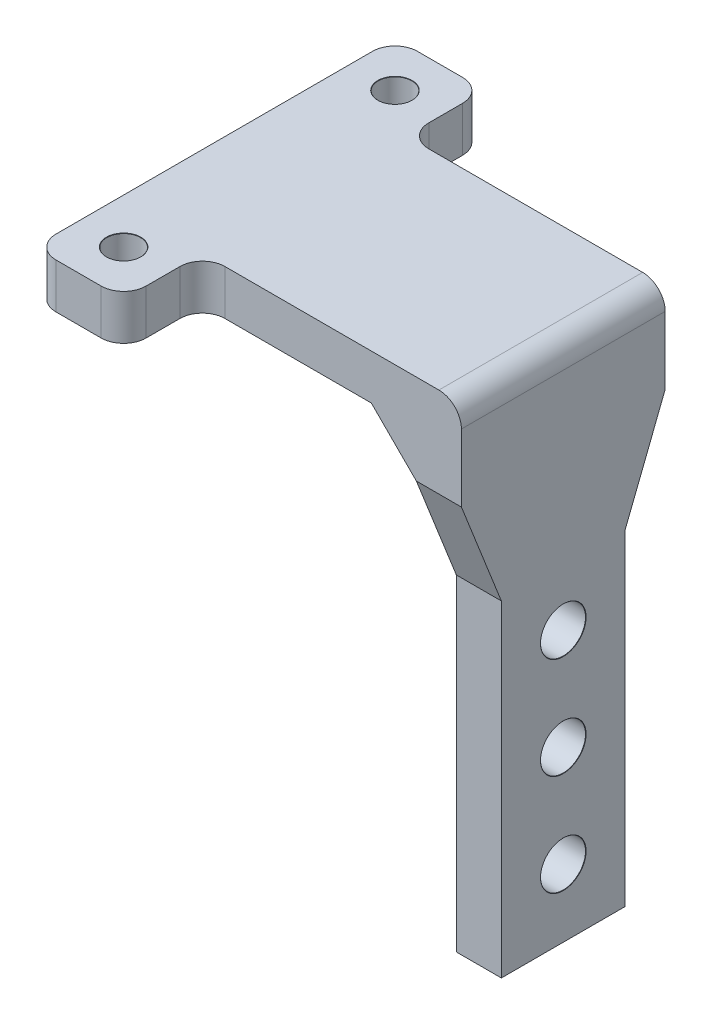
ISO-10303-21;
HEADER;
FILE_DESCRIPTION(('STEP AP214'),'2;1');
FILE_NAME('part.step','',(''),(''),'','','');
FILE_SCHEMA(('AUTOMOTIVE_DESIGN { 1 0 10303 214 1 1 1 1 }'));
ENDSEC;
DATA;
#1=APPLICATION_CONTEXT('core data for automotive mechanical design processes');
#2=APPLICATION_PROTOCOL_DEFINITION('international standard','automotive_design',2000,#1);
#3=PRODUCT_CONTEXT('',#1,'mechanical');
#4=PRODUCT('Part','Part','',(#3));
#5=PRODUCT_RELATED_PRODUCT_CATEGORY('part','',(#4));
#6=PRODUCT_DEFINITION_FORMATION('','',#4);
#7=PRODUCT_DEFINITION_CONTEXT('part definition',#1,'design');
#8=PRODUCT_DEFINITION('design','',#6,#7);
#9=PRODUCT_DEFINITION_SHAPE('','',#8);
#10=(LENGTH_UNIT() NAMED_UNIT(*) SI_UNIT(.MILLI.,.METRE.));
#11=(NAMED_UNIT(*) PLANE_ANGLE_UNIT() SI_UNIT($,.RADIAN.));
#12=(NAMED_UNIT(*) SI_UNIT($,.STERADIAN.) SOLID_ANGLE_UNIT());
#13=UNCERTAINTY_MEASURE_WITH_UNIT(LENGTH_MEASURE(1.E-05),#10,'distance_accuracy_value','');
#14=(GEOMETRIC_REPRESENTATION_CONTEXT(3) GLOBAL_UNCERTAINTY_ASSIGNED_CONTEXT((#13)) GLOBAL_UNIT_ASSIGNED_CONTEXT((#10,
#11,#12)) REPRESENTATION_CONTEXT('',''));
#15=CARTESIAN_POINT('',(0.,0.,0.));
#16=DIRECTION('',(0.,0.,1.));
#17=DIRECTION('',(1.,0.,0.));
#18=AXIS2_PLACEMENT_3D('',#15,#16,#17);
#19=CARTESIAN_POINT('',(0.,0.,0.));
#20=DIRECTION('',(0.,1.,0.));
#21=DIRECTION('',(0.,0.,1.));
#22=AXIS2_PLACEMENT_3D('',#19,#20,#21);
#23=PLANE('',#22);
#24=CARTESIAN_POINT('',(4.,0.,12.05));
#25=DIRECTION('',(0.,1.,0.));
#26=DIRECTION('',(0.,0.,1.));
#27=AXIS2_PLACEMENT_3D('',#24,#25,#26);
#28=CIRCLE('',#27,1.5);
#29=CARTESIAN_POINT('',(4.,0.,13.55));
#30=VERTEX_POINT('',#29);
#31=EDGE_CURVE('E342',#30,#30,#28,.T.);
#32=ORIENTED_EDGE('',*,*,#31,.T.);
#33=EDGE_LOOP('',(#32));
#34=FACE_BOUND('',#33,.T.);
#35=CARTESIAN_POINT('',(4.,0.,-12.05));
#36=DIRECTION('',(0.,1.,0.));
#37=DIRECTION('',(0.,0.,1.));
#38=AXIS2_PLACEMENT_3D('',#35,#36,#37);
#39=CIRCLE('',#38,1.5);
#40=CARTESIAN_POINT('',(4.,0.,-10.55));
#41=VERTEX_POINT('',#40);
#42=EDGE_CURVE('E333',#41,#41,#39,.T.);
#43=ORIENTED_EDGE('',*,*,#42,.T.);
#44=EDGE_LOOP('',(#43));
#45=FACE_BOUND('',#44,.T.);
#46=DIRECTION('',(-1.,0.,0.));
#47=VECTOR('',#46,1.);
#48=CARTESIAN_POINT('',(31.,0.,-9.05));
#49=LINE('',#48,#47);
#50=CARTESIAN_POINT('',(23.,0.,-9.05));
#51=VERTEX_POINT('',#50);
#52=CARTESIAN_POINT('',(10.,0.,-9.05));
#53=VERTEX_POINT('',#52);
#54=EDGE_CURVE('E379',#51,#53,#49,.T.);
#55=ORIENTED_EDGE('',*,*,#54,.F.);
#56=DIRECTION('',(0.,0.,1.));
#57=VECTOR('',#56,1.);
#58=CARTESIAN_POINT('',(23.,0.,9.05));
#59=LINE('',#58,#57);
#60=CARTESIAN_POINT('',(23.,0.,9.05));
#61=VERTEX_POINT('',#60);
#62=EDGE_CURVE('E278',#51,#61,#59,.T.);
#63=ORIENTED_EDGE('',*,*,#62,.T.);
#64=DIRECTION('',(1.,0.,0.));
#65=VECTOR('',#64,1.);
#66=CARTESIAN_POINT('',(8.,0.,9.05));
#67=LINE('',#66,#65);
#68=CARTESIAN_POINT('',(10.,0.,9.05));
#69=VERTEX_POINT('',#68);
#70=EDGE_CURVE('E377',#69,#61,#67,.T.);
#71=ORIENTED_EDGE('',*,*,#70,.F.);
#72=CARTESIAN_POINT('',(10.,0.,11.05));
#73=DIRECTION('',(0.,1.,0.));
#74=DIRECTION('',(0.,0.,1.));
#75=AXIS2_PLACEMENT_3D('',#72,#73,#74);
#76=CIRCLE('',#75,2.);
#77=CARTESIAN_POINT('',(8.,0.,11.05));
#78=VERTEX_POINT('',#77);
#79=EDGE_CURVE('E271',#69,#78,#76,.T.);
#80=ORIENTED_EDGE('',*,*,#79,.T.);
#81=DIRECTION('',(0.,0.,-1.));
#82=VECTOR('',#81,1.);
#83=CARTESIAN_POINT('',(8.,0.,16.05));
#84=LINE('',#83,#82);
#85=CARTESIAN_POINT('',(8.,0.,14.05));
#86=VERTEX_POINT('',#85);
#87=EDGE_CURVE('E374',#86,#78,#84,.T.);
#88=ORIENTED_EDGE('',*,*,#87,.F.);
#89=CARTESIAN_POINT('',(6.,0.,14.05));
#90=DIRECTION('',(0.,1.,0.));
#91=DIRECTION('',(0.,0.,1.));
#92=AXIS2_PLACEMENT_3D('',#89,#90,#91);
#93=CIRCLE('',#92,2.);
#94=CARTESIAN_POINT('',(6.,0.,16.05));
#95=VERTEX_POINT('',#94);
#96=EDGE_CURVE('E224',#86,#95,#93,.F.);
#97=ORIENTED_EDGE('',*,*,#96,.T.);
#98=DIRECTION('',(1.,0.,0.));
#99=VECTOR('',#98,1.);
#100=CARTESIAN_POINT('',(0.,0.,16.05));
#101=LINE('',#100,#99);
#102=CARTESIAN_POINT('',(2.,0.,16.05));
#103=VERTEX_POINT('',#102);
#104=EDGE_CURVE('E371',#103,#95,#101,.T.);
#105=ORIENTED_EDGE('',*,*,#104,.F.);
#106=CARTESIAN_POINT('',(2.,0.,14.05));
#107=DIRECTION('',(0.,1.,0.));
#108=DIRECTION('',(0.,0.,1.));
#109=AXIS2_PLACEMENT_3D('',#106,#107,#108);
#110=CIRCLE('',#109,2.);
#111=CARTESIAN_POINT('',(0.,0.,14.05));
#112=VERTEX_POINT('',#111);
#113=EDGE_CURVE('E226',#103,#112,#110,.F.);
#114=ORIENTED_EDGE('',*,*,#113,.T.);
#115=DIRECTION('',(0.,0.,1.));
#116=VECTOR('',#115,1.);
#117=CARTESIAN_POINT('',(0.,0.,-16.05));
#118=LINE('',#117,#116);
#119=CARTESIAN_POINT('',(0.,0.,-14.05));
#120=VERTEX_POINT('',#119);
#121=EDGE_CURVE('E368',#120,#112,#118,.T.);
#122=ORIENTED_EDGE('',*,*,#121,.F.);
#123=CARTESIAN_POINT('',(2.,0.,-14.05));
#124=DIRECTION('',(0.,1.,0.));
#125=DIRECTION('',(0.,0.,1.));
#126=AXIS2_PLACEMENT_3D('',#123,#124,#125);
#127=CIRCLE('',#126,2.);
#128=CARTESIAN_POINT('',(2.,0.,-16.05));
#129=VERTEX_POINT('',#128);
#130=EDGE_CURVE('E230',#120,#129,#127,.F.);
#131=ORIENTED_EDGE('',*,*,#130,.T.);
#132=DIRECTION('',(-1.,0.,0.));
#133=VECTOR('',#132,1.);
#134=CARTESIAN_POINT('',(8.,0.,-16.05));
#135=LINE('',#134,#133);
#136=CARTESIAN_POINT('',(6.,0.,-16.05));
#137=VERTEX_POINT('',#136);
#138=EDGE_CURVE('E345',#137,#129,#135,.T.);
#139=ORIENTED_EDGE('',*,*,#138,.F.);
#140=CARTESIAN_POINT('',(6.,0.,-14.05));
#141=DIRECTION('',(0.,1.,0.));
#142=DIRECTION('',(0.,0.,1.));
#143=AXIS2_PLACEMENT_3D('',#140,#141,#142);
#144=CIRCLE('',#143,2.);
#145=CARTESIAN_POINT('',(8.,0.,-14.05));
#146=VERTEX_POINT('',#145);
#147=EDGE_CURVE('E228',#137,#146,#144,.F.);
#148=ORIENTED_EDGE('',*,*,#147,.T.);
#149=DIRECTION('',(0.,0.,-1.));
#150=VECTOR('',#149,1.);
#151=CARTESIAN_POINT('',(8.,0.,-9.05));
#152=LINE('',#151,#150);
#153=CARTESIAN_POINT('',(8.,0.,-11.05));
#154=VERTEX_POINT('',#153);
#155=EDGE_CURVE('E350',#154,#146,#152,.T.);
#156=ORIENTED_EDGE('',*,*,#155,.F.);
#157=CARTESIAN_POINT('',(10.,0.,-11.05));
#158=DIRECTION('',(0.,1.,0.));
#159=DIRECTION('',(0.,0.,1.));
#160=AXIS2_PLACEMENT_3D('',#157,#158,#159);
#161=CIRCLE('',#160,2.);
#162=EDGE_CURVE('E266',#154,#53,#161,.T.);
#163=ORIENTED_EDGE('',*,*,#162,.T.);
#164=EDGE_LOOP('',(#55,#63,#71,#80,#88,#97,#105,#114,#122,#131,#139,#148,#156,#163));
#165=FACE_BOUND('',#164,.T.);
#166=ADVANCED_FACE('F41',(#34,#45,#165),#23,.F.);
#167=CARTESIAN_POINT('',(8.,4.,-16.05));
#168=DIRECTION('',(0.,0.,1.));
#169=DIRECTION('',(1.,0.,0.));
#170=AXIS2_PLACEMENT_3D('',#167,#168,#169);
#171=PLANE('',#170);
#172=ORIENTED_EDGE('',*,*,#138,.T.);
#173=DIRECTION('',(0.,-1.,0.));
#174=VECTOR('',#173,1.);
#175=CARTESIAN_POINT('',(2.,4.,-16.05));
#176=LINE('',#175,#174);
#177=CARTESIAN_POINT('',(2.,4.,-16.05));
#178=VERTEX_POINT('',#177);
#179=EDGE_CURVE('E235',#129,#178,#176,.F.);
#180=ORIENTED_EDGE('',*,*,#179,.T.);
#181=DIRECTION('',(-1.,0.,0.));
#182=VECTOR('',#181,1.);
#183=CARTESIAN_POINT('',(8.,4.,-16.05));
#184=LINE('',#183,#182);
#185=CARTESIAN_POINT('',(6.,4.,-16.05));
#186=VERTEX_POINT('',#185);
#187=EDGE_CURVE('E346',#186,#178,#184,.T.);
#188=ORIENTED_EDGE('',*,*,#187,.F.);
#189=DIRECTION('',(0.,-1.,0.));
#190=VECTOR('',#189,1.);
#191=CARTESIAN_POINT('',(6.,4.,-16.05));
#192=LINE('',#191,#190);
#193=EDGE_CURVE('E232',#186,#137,#192,.T.);
#194=ORIENTED_EDGE('',*,*,#193,.T.);
#195=EDGE_LOOP('',(#172,#180,#188,#194));
#196=FACE_BOUND('',#195,.T.);
#197=ADVANCED_FACE('F397',(#196),#171,.F.);
#198=CARTESIAN_POINT('',(0.,4.,-16.05));
#199=DIRECTION('',(1.,0.,0.));
#200=DIRECTION('',(0.,0.,-1.));
#201=AXIS2_PLACEMENT_3D('',#198,#199,#200);
#202=PLANE('',#201);
#203=DIRECTION('',(0.,0.,1.));
#204=VECTOR('',#203,1.);
#205=CARTESIAN_POINT('',(0.,4.,-16.05));
#206=LINE('',#205,#204);
#207=CARTESIAN_POINT('',(0.,4.,-14.05));
#208=VERTEX_POINT('',#207);
#209=CARTESIAN_POINT('',(0.,4.,14.05));
#210=VERTEX_POINT('',#209);
#211=EDGE_CURVE('E349',#208,#210,#206,.T.);
#212=ORIENTED_EDGE('',*,*,#211,.F.);
#213=DIRECTION('',(0.,-1.,0.));
#214=VECTOR('',#213,1.);
#215=CARTESIAN_POINT('',(0.,4.,-14.05));
#216=LINE('',#215,#214);
#217=EDGE_CURVE('E215',#208,#120,#216,.T.);
#218=ORIENTED_EDGE('',*,*,#217,.T.);
#219=ORIENTED_EDGE('',*,*,#121,.T.);
#220=DIRECTION('',(0.,-1.,0.));
#221=VECTOR('',#220,1.);
#222=CARTESIAN_POINT('',(0.,4.,14.05));
#223=LINE('',#222,#221);
#224=EDGE_CURVE('E212',#112,#210,#223,.F.);
#225=ORIENTED_EDGE('',*,*,#224,.T.);
#226=EDGE_LOOP('',(#212,#218,#219,#225));
#227=FACE_BOUND('',#226,.T.);
#228=ADVANCED_FACE('F406',(#227),#202,.F.);
#229=CARTESIAN_POINT('',(0.,4.,16.05));
#230=DIRECTION('',(0.,0.,-1.));
#231=DIRECTION('',(-1.,0.,0.));
#232=AXIS2_PLACEMENT_3D('',#229,#230,#231);
#233=PLANE('',#232);
#234=DIRECTION('',(1.,0.,0.));
#235=VECTOR('',#234,1.);
#236=CARTESIAN_POINT('',(0.,4.,16.05));
#237=LINE('',#236,#235);
#238=CARTESIAN_POINT('',(2.,4.,16.05));
#239=VERTEX_POINT('',#238);
#240=CARTESIAN_POINT('',(6.,4.,16.05));
#241=VERTEX_POINT('',#240);
#242=EDGE_CURVE('E353',#239,#241,#237,.T.);
#243=ORIENTED_EDGE('',*,*,#242,.F.);
#244=DIRECTION('',(0.,-1.,0.));
#245=VECTOR('',#244,1.);
#246=CARTESIAN_POINT('',(2.,4.,16.05));
#247=LINE('',#246,#245);
#248=EDGE_CURVE('E255',#239,#103,#247,.T.);
#249=ORIENTED_EDGE('',*,*,#248,.T.);
#250=ORIENTED_EDGE('',*,*,#104,.T.);
#251=DIRECTION('',(0.,-1.,0.));
#252=VECTOR('',#251,1.);
#253=CARTESIAN_POINT('',(6.,4.,16.05));
#254=LINE('',#253,#252);
#255=EDGE_CURVE('E253',#95,#241,#254,.F.);
#256=ORIENTED_EDGE('',*,*,#255,.T.);
#257=EDGE_LOOP('',(#243,#249,#250,#256));
#258=FACE_BOUND('',#257,.T.);
#259=ADVANCED_FACE('F415',(#258),#233,.F.);
#260=CARTESIAN_POINT('',(8.,4.,16.05));
#261=DIRECTION('',(-1.,0.,0.));
#262=DIRECTION('',(0.,0.,1.));
#263=AXIS2_PLACEMENT_3D('',#260,#261,#262);
#264=PLANE('',#263);
#265=DIRECTION('',(0.,0.,-1.));
#266=VECTOR('',#265,1.);
#267=CARTESIAN_POINT('',(8.,4.,16.05));
#268=LINE('',#267,#266);
#269=CARTESIAN_POINT('',(8.,4.,14.05));
#270=VERTEX_POINT('',#269);
#271=CARTESIAN_POINT('',(8.,4.,11.05));
#272=VERTEX_POINT('',#271);
#273=EDGE_CURVE('E356',#270,#272,#268,.T.);
#274=ORIENTED_EDGE('',*,*,#273,.F.);
#275=DIRECTION('',(0.,-1.,0.));
#276=VECTOR('',#275,1.);
#277=CARTESIAN_POINT('',(8.,4.,14.05));
#278=LINE('',#277,#276);
#279=EDGE_CURVE('E260',#270,#86,#278,.T.);
#280=ORIENTED_EDGE('',*,*,#279,.T.);
#281=ORIENTED_EDGE('',*,*,#87,.T.);
#282=DIRECTION('',(0.,-1.,0.));
#283=VECTOR('',#282,1.);
#284=CARTESIAN_POINT('',(8.,4.,11.05));
#285=LINE('',#284,#283);
#286=EDGE_CURVE('E258',#78,#272,#285,.F.);
#287=ORIENTED_EDGE('',*,*,#286,.T.);
#288=EDGE_LOOP('',(#274,#280,#281,#287));
#289=FACE_BOUND('',#288,.T.);
#290=ADVANCED_FACE('F424',(#289),#264,.F.);
#291=CARTESIAN_POINT('',(8.,4.,9.05));
#292=DIRECTION('',(0.,0.,-1.));
#293=DIRECTION('',(-1.,0.,0.));
#294=AXIS2_PLACEMENT_3D('',#291,#292,#293);
#295=PLANE('',#294);
#296=DIRECTION('',(-0.707106781186544,0.707106781186551,0.));
#297=VECTOR('',#296,1.);
#298=CARTESIAN_POINT('',(13.5000000000001,9.50000000000002,9.05));
#299=LINE('',#298,#297);
#300=CARTESIAN_POINT('',(27.,-4.00000000000005,9.05));
#301=VERTEX_POINT('',#300);
#302=EDGE_CURVE('E205',#61,#301,#299,.F.);
#303=ORIENTED_EDGE('',*,*,#302,.T.);
#304=DIRECTION('',(-1.,0.,0.));
#305=VECTOR('',#304,1.);
#306=CARTESIAN_POINT('',(31.,-4.00000000000005,9.05));
#307=LINE('',#306,#305);
#308=CARTESIAN_POINT('',(31.,-4.00000000000005,9.05));
#309=VERTEX_POINT('',#308);
#310=EDGE_CURVE('E188',#309,#301,#307,.T.);
#311=ORIENTED_EDGE('',*,*,#310,.F.);
#312=DIRECTION('',(0.,-1.,0.));
#313=VECTOR('',#312,1.);
#314=CARTESIAN_POINT('',(31.,4.,9.05));
#315=LINE('',#314,#313);
#316=CARTESIAN_POINT('',(31.,2.,9.05));
#317=VERTEX_POINT('',#316);
#318=EDGE_CURVE('E201',#317,#309,#315,.T.);
#319=ORIENTED_EDGE('',*,*,#318,.F.);
#320=CARTESIAN_POINT('',(29.,2.,9.05));
#321=DIRECTION('',(0.,0.,-1.));
#322=DIRECTION('',(-1.,0.,0.));
#323=AXIS2_PLACEMENT_3D('',#320,#321,#322);
#324=CIRCLE('',#323,2.);
#325=CARTESIAN_POINT('',(29.,4.,9.05));
#326=VERTEX_POINT('',#325);
#327=EDGE_CURVE('E49',#317,#326,#324,.F.);
#328=ORIENTED_EDGE('',*,*,#327,.T.);
#329=DIRECTION('',(1.,0.,0.));
#330=VECTOR('',#329,1.);
#331=CARTESIAN_POINT('',(8.,4.,9.05));
#332=LINE('',#331,#330);
#333=CARTESIAN_POINT('',(10.,4.,9.05));
#334=VERTEX_POINT('',#333);
#335=EDGE_CURVE('E359',#334,#326,#332,.T.);
#336=ORIENTED_EDGE('',*,*,#335,.F.);
#337=DIRECTION('',(0.,-1.,0.));
#338=VECTOR('',#337,1.);
#339=CARTESIAN_POINT('',(10.,0.,9.05));
#340=LINE('',#339,#338);
#341=EDGE_CURVE('E263',#334,#69,#340,.T.);
#342=ORIENTED_EDGE('',*,*,#341,.T.);
#343=ORIENTED_EDGE('',*,*,#70,.T.);
#344=EDGE_LOOP('',(#303,#311,#319,#328,#336,#342,#343));
#345=FACE_BOUND('',#344,.T.);
#346=ADVANCED_FACE('F200',(#345),#295,.F.);
#347=CARTESIAN_POINT('',(31.,4.,9.05));
#348=DIRECTION('',(-1.,0.,0.));
#349=DIRECTION('',(0.,0.,1.));
#350=AXIS2_PLACEMENT_3D('',#347,#348,#349);
#351=PLANE('',#350);
#352=CARTESIAN_POINT('',(31.,-36.,0.));
#353=DIRECTION('',(1.,0.,0.));
#354=DIRECTION('',(0.,0.,-1.));
#355=AXIS2_PLACEMENT_3D('',#352,#353,#354);
#356=CIRCLE('',#355,2.025);
#357=CARTESIAN_POINT('',(31.,-36.,-2.025));
#358=VERTEX_POINT('',#357);
#359=EDGE_CURVE('E308',#358,#358,#356,.T.);
#360=ORIENTED_EDGE('',*,*,#359,.F.);
#361=EDGE_LOOP('',(#360));
#362=FACE_BOUND('',#361,.T.);
#363=CARTESIAN_POINT('',(31.,-27.,0.));
#364=DIRECTION('',(1.,0.,0.));
#365=DIRECTION('',(0.,0.,-1.));
#366=AXIS2_PLACEMENT_3D('',#363,#364,#365);
#367=CIRCLE('',#366,2.025);
#368=CARTESIAN_POINT('',(31.,-27.,-2.025));
#369=VERTEX_POINT('',#368);
#370=EDGE_CURVE('E301',#369,#369,#367,.T.);
#371=ORIENTED_EDGE('',*,*,#370,.F.);
#372=EDGE_LOOP('',(#371));
#373=FACE_BOUND('',#372,.T.);
#374=CARTESIAN_POINT('',(31.,-18.,0.));
#375=DIRECTION('',(1.,0.,0.));
#376=DIRECTION('',(0.,0.,-1.));
#377=AXIS2_PLACEMENT_3D('',#374,#375,#376);
#378=CIRCLE('',#377,2.025);
#379=CARTESIAN_POINT('',(31.,-18.,-2.025));
#380=VERTEX_POINT('',#379);
#381=EDGE_CURVE('E297',#380,#380,#378,.T.);
#382=ORIENTED_EDGE('',*,*,#381,.F.);
#383=EDGE_LOOP('',(#382));
#384=FACE_BOUND('',#383,.T.);
#385=DIRECTION('',(0.,-0.930248086317103,-0.366931189602858));
#386=VECTOR('',#385,1.);
#387=CARTESIAN_POINT('',(31.,-4.00000000000005,9.05));
#388=LINE('',#387,#386);
#389=CARTESIAN_POINT('',(31.,-13.,5.5));
#390=VERTEX_POINT('',#389);
#391=EDGE_CURVE('E184',#309,#390,#388,.T.);
#392=ORIENTED_EDGE('',*,*,#391,.T.);
#393=DIRECTION('',(0.,-1.,0.));
#394=VECTOR('',#393,1.);
#395=CARTESIAN_POINT('',(31.,-13.,5.5));
#396=LINE('',#395,#394);
#397=CARTESIAN_POINT('',(31.,-42.,5.5));
#398=VERTEX_POINT('',#397);
#399=EDGE_CURVE('E195',#390,#398,#396,.T.);
#400=ORIENTED_EDGE('',*,*,#399,.T.);
#401=DIRECTION('',(0.,0.,1.));
#402=VECTOR('',#401,1.);
#403=CARTESIAN_POINT('',(31.,-42.,9.05));
#404=LINE('',#403,#402);
#405=CARTESIAN_POINT('',(31.,-42.,-5.499999999941));
#406=VERTEX_POINT('',#405);
#407=EDGE_CURVE('E293',#406,#398,#404,.T.);
#408=ORIENTED_EDGE('',*,*,#407,.F.);
#409=DIRECTION('',(0.,1.,0.));
#410=VECTOR('',#409,1.);
#411=CARTESIAN_POINT('',(31.,-13.,-5.499999999941));
#412=LINE('',#411,#410);
#413=CARTESIAN_POINT('',(31.,-13.,-5.499999999941));
#414=VERTEX_POINT('',#413);
#415=EDGE_CURVE('E64',#406,#414,#412,.T.);
#416=ORIENTED_EDGE('',*,*,#415,.T.);
#417=DIRECTION('',(0.,0.930248086315021,-0.366931189608135));
#418=VECTOR('',#417,1.);
#419=CARTESIAN_POINT('',(31.,-4.00000000000005,-9.05));
#420=LINE('',#419,#418);
#421=CARTESIAN_POINT('',(31.,-4.00000000000005,-9.05));
#422=VERTEX_POINT('',#421);
#423=EDGE_CURVE('E459',#414,#422,#420,.T.);
#424=ORIENTED_EDGE('',*,*,#423,.T.);
#425=DIRECTION('',(0.,-1.,0.));
#426=VECTOR('',#425,1.);
#427=CARTESIAN_POINT('',(31.,4.,-9.05));
#428=LINE('',#427,#426);
#429=CARTESIAN_POINT('',(31.,2.,-9.05));
#430=VERTEX_POINT('',#429);
#431=EDGE_CURVE('E213',#430,#422,#428,.T.);
#432=ORIENTED_EDGE('',*,*,#431,.F.);
#433=DIRECTION('',(0.,0.,-1.));
#434=VECTOR('',#433,1.);
#435=CARTESIAN_POINT('',(31.,2.,9.05));
#436=LINE('',#435,#434);
#437=EDGE_CURVE('E211',#430,#317,#436,.F.);
#438=ORIENTED_EDGE('',*,*,#437,.T.);
#439=ORIENTED_EDGE('',*,*,#318,.T.);
#440=EDGE_LOOP('',(#392,#400,#408,#416,#424,#432,#438,#439));
#441=FACE_BOUND('',#440,.T.);
#442=ADVANCED_FACE('F208',(#362,#373,#384,#441),#351,.F.);
#443=CARTESIAN_POINT('',(31.,4.,-9.05));
#444=DIRECTION('',(0.,0.,1.));
#445=DIRECTION('',(1.,0.,0.));
#446=AXIS2_PLACEMENT_3D('',#443,#444,#445);
#447=PLANE('',#446);
#448=ORIENTED_EDGE('',*,*,#431,.T.);
#449=DIRECTION('',(-1.,0.,0.));
#450=VECTOR('',#449,1.);
#451=CARTESIAN_POINT('',(31.,-4.00000000000005,-9.05));
#452=LINE('',#451,#450);
#453=CARTESIAN_POINT('',(27.,-4.00000000000005,-9.05));
#454=VERTEX_POINT('',#453);
#455=EDGE_CURVE('E463',#422,#454,#452,.T.);
#456=ORIENTED_EDGE('',*,*,#455,.T.);
#457=DIRECTION('',(0.707106781186544,-0.707106781186551,0.));
#458=VECTOR('',#457,1.);
#459=CARTESIAN_POINT('',(25.,-1.99999999999998,-9.05));
#460=LINE('',#459,#458);
#461=EDGE_CURVE('E280',#454,#51,#460,.F.);
#462=ORIENTED_EDGE('',*,*,#461,.T.);
#463=ORIENTED_EDGE('',*,*,#54,.T.);
#464=DIRECTION('',(0.,-1.,0.));
#465=VECTOR('',#464,1.);
#466=CARTESIAN_POINT('',(10.,4.,-9.05));
#467=LINE('',#466,#465);
#468=CARTESIAN_POINT('',(10.,4.,-9.05));
#469=VERTEX_POINT('',#468);
#470=EDGE_CURVE('E250',#53,#469,#467,.F.);
#471=ORIENTED_EDGE('',*,*,#470,.T.);
#472=DIRECTION('',(-1.,0.,0.));
#473=VECTOR('',#472,1.);
#474=CARTESIAN_POINT('',(31.,4.,-9.05));
#475=LINE('',#474,#473);
#476=CARTESIAN_POINT('',(29.,4.,-9.05));
#477=VERTEX_POINT('',#476);
#478=EDGE_CURVE('E362',#477,#469,#475,.T.);
#479=ORIENTED_EDGE('',*,*,#478,.F.);
#480=CARTESIAN_POINT('',(29.,2.,-9.05));
#481=DIRECTION('',(0.,0.,1.));
#482=DIRECTION('',(1.,0.,0.));
#483=AXIS2_PLACEMENT_3D('',#480,#481,#482);
#484=CIRCLE('',#483,2.);
#485=EDGE_CURVE('E286',#477,#430,#484,.F.);
#486=ORIENTED_EDGE('',*,*,#485,.T.);
#487=EDGE_LOOP('',(#448,#456,#462,#463,#471,#479,#486));
#488=FACE_BOUND('',#487,.T.);
#489=ADVANCED_FACE('F436',(#488),#447,.F.);
#490=CARTESIAN_POINT('',(8.,4.,-9.05));
#491=DIRECTION('',(-1.,0.,0.));
#492=DIRECTION('',(0.,0.,1.));
#493=AXIS2_PLACEMENT_3D('',#490,#491,#492);
#494=PLANE('',#493);
#495=DIRECTION('',(0.,0.,-1.));
#496=VECTOR('',#495,1.);
#497=CARTESIAN_POINT('',(8.,4.,-9.05));
#498=LINE('',#497,#496);
#499=CARTESIAN_POINT('',(8.,4.,-11.05));
#500=VERTEX_POINT('',#499);
#501=CARTESIAN_POINT('',(8.,4.,-14.05));
#502=VERTEX_POINT('',#501);
#503=EDGE_CURVE('E218',#500,#502,#498,.T.);
#504=ORIENTED_EDGE('',*,*,#503,.F.);
#505=DIRECTION('',(0.,-1.,0.));
#506=VECTOR('',#505,1.);
#507=CARTESIAN_POINT('',(8.,0.,-11.05));
#508=LINE('',#507,#506);
#509=EDGE_CURVE('E247',#500,#154,#508,.T.);
#510=ORIENTED_EDGE('',*,*,#509,.T.);
#511=ORIENTED_EDGE('',*,*,#155,.T.);
#512=DIRECTION('',(0.,-1.,0.));
#513=VECTOR('',#512,1.);
#514=CARTESIAN_POINT('',(8.,4.,-14.05));
#515=LINE('',#514,#513);
#516=EDGE_CURVE('E245',#146,#502,#515,.F.);
#517=ORIENTED_EDGE('',*,*,#516,.T.);
#518=EDGE_LOOP('',(#504,#510,#511,#517));
#519=FACE_BOUND('',#518,.T.);
#520=ADVANCED_FACE('F385',(#519),#494,.F.);
#521=CARTESIAN_POINT('',(0.,4.,0.));
#522=DIRECTION('',(0.,1.,0.));
#523=DIRECTION('',(0.,0.,1.));
#524=AXIS2_PLACEMENT_3D('',#521,#522,#523);
#525=PLANE('',#524);
#526=CARTESIAN_POINT('',(4.,4.,-12.05));
#527=DIRECTION('',(0.,1.,0.));
#528=DIRECTION('',(0.,0.,1.));
#529=AXIS2_PLACEMENT_3D('',#526,#527,#528);
#530=CIRCLE('',#529,1.525);
#531=CARTESIAN_POINT('',(4.,4.,-10.525));
#532=VERTEX_POINT('',#531);
#533=EDGE_CURVE('E327',#532,#532,#530,.T.);
#534=ORIENTED_EDGE('',*,*,#533,.F.);
#535=EDGE_LOOP('',(#534));
#536=FACE_BOUND('',#535,.T.);
#537=CARTESIAN_POINT('',(4.,4.,12.05));
#538=DIRECTION('',(0.,1.,0.));
#539=DIRECTION('',(0.,0.,1.));
#540=AXIS2_PLACEMENT_3D('',#537,#538,#539);
#541=CIRCLE('',#540,1.525);
#542=CARTESIAN_POINT('',(4.,4.,13.575));
#543=VERTEX_POINT('',#542);
#544=EDGE_CURVE('E336',#543,#543,#541,.T.);
#545=ORIENTED_EDGE('',*,*,#544,.F.);
#546=EDGE_LOOP('',(#545));
#547=FACE_BOUND('',#546,.T.);
#548=ORIENTED_EDGE('',*,*,#335,.T.);
#549=DIRECTION('',(0.,0.,-1.));
#550=VECTOR('',#549,1.);
#551=CARTESIAN_POINT('',(29.,4.,-9.05));
#552=LINE('',#551,#550);
#553=EDGE_CURVE('E283',#326,#477,#552,.T.);
#554=ORIENTED_EDGE('',*,*,#553,.T.);
#555=ORIENTED_EDGE('',*,*,#478,.T.);
#556=CARTESIAN_POINT('',(10.,4.,-11.05));
#557=DIRECTION('',(0.,1.,0.));
#558=DIRECTION('',(0.,0.,1.));
#559=AXIS2_PLACEMENT_3D('',#556,#557,#558);
#560=CIRCLE('',#559,2.);
#561=EDGE_CURVE('E269',#469,#500,#560,.F.);
#562=ORIENTED_EDGE('',*,*,#561,.T.);
#563=ORIENTED_EDGE('',*,*,#503,.T.);
#564=CARTESIAN_POINT('',(6.,4.,-14.05));
#565=DIRECTION('',(0.,1.,0.));
#566=DIRECTION('',(0.,0.,1.));
#567=AXIS2_PLACEMENT_3D('',#564,#565,#566);
#568=CIRCLE('',#567,2.);
#569=EDGE_CURVE('E241',#502,#186,#568,.T.);
#570=ORIENTED_EDGE('',*,*,#569,.T.);
#571=ORIENTED_EDGE('',*,*,#187,.T.);
#572=CARTESIAN_POINT('',(2.,4.,-14.05));
#573=DIRECTION('',(0.,1.,0.));
#574=DIRECTION('',(0.,0.,1.));
#575=AXIS2_PLACEMENT_3D('',#572,#573,#574);
#576=CIRCLE('',#575,2.);
#577=EDGE_CURVE('E243',#178,#208,#576,.T.);
#578=ORIENTED_EDGE('',*,*,#577,.T.);
#579=ORIENTED_EDGE('',*,*,#211,.T.);
#580=CARTESIAN_POINT('',(2.,4.,14.05));
#581=DIRECTION('',(0.,1.,0.));
#582=DIRECTION('',(0.,0.,1.));
#583=AXIS2_PLACEMENT_3D('',#580,#581,#582);
#584=CIRCLE('',#583,2.);
#585=EDGE_CURVE('E239',#210,#239,#584,.T.);
#586=ORIENTED_EDGE('',*,*,#585,.T.);
#587=ORIENTED_EDGE('',*,*,#242,.T.);
#588=CARTESIAN_POINT('',(6.,4.,14.05));
#589=DIRECTION('',(0.,1.,0.));
#590=DIRECTION('',(0.,0.,1.));
#591=AXIS2_PLACEMENT_3D('',#588,#589,#590);
#592=CIRCLE('',#591,2.);
#593=EDGE_CURVE('E237',#241,#270,#592,.T.);
#594=ORIENTED_EDGE('',*,*,#593,.T.);
#595=ORIENTED_EDGE('',*,*,#273,.T.);
#596=CARTESIAN_POINT('',(10.,4.,11.05));
#597=DIRECTION('',(0.,1.,0.));
#598=DIRECTION('',(0.,0.,1.));
#599=AXIS2_PLACEMENT_3D('',#596,#597,#598);
#600=CIRCLE('',#599,2.);
#601=EDGE_CURVE('E273',#272,#334,#600,.F.);
#602=ORIENTED_EDGE('',*,*,#601,.T.);
#603=EDGE_LOOP('',(#548,#554,#555,#562,#563,#570,#571,#578,#579,#586,#587,#594,#595,#602));
#604=FACE_BOUND('',#603,.T.);
#605=ADVANCED_FACE('F394',(#536,#547,#604),#525,.T.);
#606=CARTESIAN_POINT('',(2.,4.,-14.05));
#607=DIRECTION('',(0.,-1.,0.));
#608=DIRECTION('',(0.,0.,-1.));
#609=AXIS2_PLACEMENT_3D('',#606,#607,#608);
#610=CYLINDRICAL_SURFACE('',#609,2.);
#611=ORIENTED_EDGE('',*,*,#577,.F.);
#612=ORIENTED_EDGE('',*,*,#179,.F.);
#613=ORIENTED_EDGE('',*,*,#130,.F.);
#614=ORIENTED_EDGE('',*,*,#217,.F.);
#615=EDGE_LOOP('',(#611,#612,#613,#614));
#616=FACE_BOUND('',#615,.T.);
#617=ADVANCED_FACE('F401',(#616),#610,.T.);
#618=CARTESIAN_POINT('',(10.,4.,-11.05));
#619=DIRECTION('',(0.,1.,0.));
#620=DIRECTION('',(0.,0.,1.));
#621=AXIS2_PLACEMENT_3D('',#618,#619,#620);
#622=CYLINDRICAL_SURFACE('',#621,2.);
#623=ORIENTED_EDGE('',*,*,#561,.F.);
#624=ORIENTED_EDGE('',*,*,#470,.F.);
#625=ORIENTED_EDGE('',*,*,#162,.F.);
#626=ORIENTED_EDGE('',*,*,#509,.F.);
#627=EDGE_LOOP('',(#623,#624,#625,#626));
#628=FACE_BOUND('',#627,.T.);
#629=ADVANCED_FACE('F441',(#628),#622,.F.);
#630=CARTESIAN_POINT('',(6.,4.,-14.05));
#631=DIRECTION('',(0.,-1.,0.));
#632=DIRECTION('',(0.,0.,-1.));
#633=AXIS2_PLACEMENT_3D('',#630,#631,#632);
#634=CYLINDRICAL_SURFACE('',#633,2.);
#635=ORIENTED_EDGE('',*,*,#569,.F.);
#636=ORIENTED_EDGE('',*,*,#516,.F.);
#637=ORIENTED_EDGE('',*,*,#147,.F.);
#638=ORIENTED_EDGE('',*,*,#193,.F.);
#639=EDGE_LOOP('',(#635,#636,#637,#638));
#640=FACE_BOUND('',#639,.T.);
#641=ADVANCED_FACE('F390',(#640),#634,.T.);
#642=CARTESIAN_POINT('',(2.,4.,14.05));
#643=DIRECTION('',(0.,-1.,0.));
#644=DIRECTION('',(0.,0.,-1.));
#645=AXIS2_PLACEMENT_3D('',#642,#643,#644);
#646=CYLINDRICAL_SURFACE('',#645,2.);
#647=ORIENTED_EDGE('',*,*,#585,.F.);
#648=ORIENTED_EDGE('',*,*,#224,.F.);
#649=ORIENTED_EDGE('',*,*,#113,.F.);
#650=ORIENTED_EDGE('',*,*,#248,.F.);
#651=EDGE_LOOP('',(#647,#648,#649,#650));
#652=FACE_BOUND('',#651,.T.);
#653=ADVANCED_FACE('F410',(#652),#646,.T.);
#654=CARTESIAN_POINT('',(6.,4.,14.05));
#655=DIRECTION('',(0.,-1.,0.));
#656=DIRECTION('',(0.,0.,-1.));
#657=AXIS2_PLACEMENT_3D('',#654,#655,#656);
#658=CYLINDRICAL_SURFACE('',#657,2.);
#659=ORIENTED_EDGE('',*,*,#593,.F.);
#660=ORIENTED_EDGE('',*,*,#255,.F.);
#661=ORIENTED_EDGE('',*,*,#96,.F.);
#662=ORIENTED_EDGE('',*,*,#279,.F.);
#663=EDGE_LOOP('',(#659,#660,#661,#662));
#664=FACE_BOUND('',#663,.T.);
#665=ADVANCED_FACE('F419',(#664),#658,.T.);
#666=CARTESIAN_POINT('',(10.,4.,11.05));
#667=DIRECTION('',(0.,1.,0.));
#668=DIRECTION('',(0.,0.,1.));
#669=AXIS2_PLACEMENT_3D('',#666,#667,#668);
#670=CYLINDRICAL_SURFACE('',#669,2.);
#671=ORIENTED_EDGE('',*,*,#601,.F.);
#672=ORIENTED_EDGE('',*,*,#286,.F.);
#673=ORIENTED_EDGE('',*,*,#79,.F.);
#674=ORIENTED_EDGE('',*,*,#341,.F.);
#675=EDGE_LOOP('',(#671,#672,#673,#674));
#676=FACE_BOUND('',#675,.T.);
#677=ADVANCED_FACE('F428',(#676),#670,.F.);
#678=CARTESIAN_POINT('',(4.,4.,12.05));
#679=DIRECTION('',(0.,1.,0.));
#680=DIRECTION('',(0.,0.,1.));
#681=AXIS2_PLACEMENT_3D('',#678,#679,#680);
#682=CYLINDRICAL_SURFACE('',#681,1.5);
#683=ORIENTED_EDGE('',*,*,#31,.F.);
#684=EDGE_LOOP('',(#683));
#685=FACE_BOUND('',#684,.T.);
#686=CARTESIAN_POINT('',(4.,3.975,12.05));
#687=DIRECTION('',(0.,1.,0.));
#688=DIRECTION('',(0.,0.,1.));
#689=AXIS2_PLACEMENT_3D('',#686,#687,#688);
#690=CIRCLE('',#689,1.5);
#691=CARTESIAN_POINT('',(4.,3.975,13.55));
#692=VERTEX_POINT('',#691);
#693=EDGE_CURVE('E339',#692,#692,#690,.T.);
#694=ORIENTED_EDGE('',*,*,#693,.T.);
#695=EDGE_LOOP('',(#694));
#696=FACE_BOUND('',#695,.T.);
#697=ADVANCED_FACE('F522',(#685,#696),#682,.F.);
#698=CARTESIAN_POINT('',(4.,4.,12.05));
#699=DIRECTION('',(0.,1.,0.));
#700=DIRECTION('',(0.,0.,1.));
#701=AXIS2_PLACEMENT_3D('',#698,#699,#700);
#702=CONICAL_SURFACE('',#701,1.525,0.785398163397466);
#703=ORIENTED_EDGE('',*,*,#693,.F.);
#704=EDGE_LOOP('',(#703));
#705=FACE_BOUND('',#704,.T.);
#706=ORIENTED_EDGE('',*,*,#544,.T.);
#707=EDGE_LOOP('',(#706));
#708=FACE_BOUND('',#707,.T.);
#709=ADVANCED_FACE('F547',(#705,#708),#702,.F.);
#710=CARTESIAN_POINT('',(4.,4.,-12.05));
#711=DIRECTION('',(0.,1.,0.));
#712=DIRECTION('',(0.,0.,1.));
#713=AXIS2_PLACEMENT_3D('',#710,#711,#712);
#714=CYLINDRICAL_SURFACE('',#713,1.5);
#715=ORIENTED_EDGE('',*,*,#42,.F.);
#716=EDGE_LOOP('',(#715));
#717=FACE_BOUND('',#716,.T.);
#718=CARTESIAN_POINT('',(4.,3.975,-12.05));
#719=DIRECTION('',(0.,1.,0.));
#720=DIRECTION('',(0.,0.,1.));
#721=AXIS2_PLACEMENT_3D('',#718,#719,#720);
#722=CIRCLE('',#721,1.5);
#723=CARTESIAN_POINT('',(4.,3.975,-10.55));
#724=VERTEX_POINT('',#723);
#725=EDGE_CURVE('E330',#724,#724,#722,.T.);
#726=ORIENTED_EDGE('',*,*,#725,.T.);
#727=EDGE_LOOP('',(#726));
#728=FACE_BOUND('',#727,.T.);
#729=ADVANCED_FACE('F543',(#717,#728),#714,.F.);
#730=CARTESIAN_POINT('',(4.,4.,-12.05));
#731=DIRECTION('',(0.,1.,0.));
#732=DIRECTION('',(0.,0.,1.));
#733=AXIS2_PLACEMENT_3D('',#730,#731,#732);
#734=CONICAL_SURFACE('',#733,1.525,0.785398163397466);
#735=ORIENTED_EDGE('',*,*,#725,.F.);
#736=EDGE_LOOP('',(#735));
#737=FACE_BOUND('',#736,.T.);
#738=ORIENTED_EDGE('',*,*,#533,.T.);
#739=EDGE_LOOP('',(#738));
#740=FACE_BOUND('',#739,.T.);
#741=ADVANCED_FACE('F536',(#737,#740),#734,.F.);
#742=CARTESIAN_POINT('',(27.,-42.,9.05));
#743=DIRECTION('',(1.,0.,0.));
#744=DIRECTION('',(0.,0.,-1.));
#745=AXIS2_PLACEMENT_3D('',#742,#743,#744);
#746=PLANE('',#745);
#747=CARTESIAN_POINT('',(27.,-36.,0.));
#748=DIRECTION('',(1.,0.,0.));
#749=DIRECTION('',(0.,0.,-1.));
#750=AXIS2_PLACEMENT_3D('',#747,#748,#749);
#751=CIRCLE('',#750,1.99999999999999);
#752=CARTESIAN_POINT('',(27.,-36.,-2.));
#753=VERTEX_POINT('',#752);
#754=EDGE_CURVE('E299',#753,#753,#751,.T.);
#755=ORIENTED_EDGE('',*,*,#754,.T.);
#756=EDGE_LOOP('',(#755));
#757=FACE_BOUND('',#756,.T.);
#758=CARTESIAN_POINT('',(27.,-27.,0.));
#759=DIRECTION('',(1.,0.,0.));
#760=DIRECTION('',(0.,0.,-1.));
#761=AXIS2_PLACEMENT_3D('',#758,#759,#760);
#762=CIRCLE('',#761,1.99999999999999);
#763=CARTESIAN_POINT('',(27.,-27.,-2.));
#764=VERTEX_POINT('',#763);
#765=EDGE_CURVE('E295',#764,#764,#762,.T.);
#766=ORIENTED_EDGE('',*,*,#765,.T.);
#767=EDGE_LOOP('',(#766));
#768=FACE_BOUND('',#767,.T.);
#769=CARTESIAN_POINT('',(27.,-18.,0.));
#770=DIRECTION('',(1.,0.,0.));
#771=DIRECTION('',(0.,0.,-1.));
#772=AXIS2_PLACEMENT_3D('',#769,#770,#771);
#773=CIRCLE('',#772,1.99999999999999);
#774=CARTESIAN_POINT('',(27.,-18.,-2.));
#775=VERTEX_POINT('',#774);
#776=EDGE_CURVE('E290',#775,#775,#773,.T.);
#777=ORIENTED_EDGE('',*,*,#776,.T.);
#778=EDGE_LOOP('',(#777));
#779=FACE_BOUND('',#778,.T.);
#780=DIRECTION('',(0.,0.,-1.));
#781=VECTOR('',#780,1.);
#782=CARTESIAN_POINT('',(27.,-42.,9.05));
#783=LINE('',#782,#781);
#784=CARTESIAN_POINT('',(27.,-42.,5.5));
#785=VERTEX_POINT('',#784);
#786=CARTESIAN_POINT('',(27.,-42.,-5.499999999941));
#787=VERTEX_POINT('',#786);
#788=EDGE_CURVE('E325',#785,#787,#783,.T.);
#789=ORIENTED_EDGE('',*,*,#788,.F.);
#790=DIRECTION('',(0.,-1.,0.));
#791=VECTOR('',#790,1.);
#792=CARTESIAN_POINT('',(27.,-13.,5.5));
#793=LINE('',#792,#791);
#794=CARTESIAN_POINT('',(27.,-13.,5.5));
#795=VERTEX_POINT('',#794);
#796=EDGE_CURVE('E56',#795,#785,#793,.T.);
#797=ORIENTED_EDGE('',*,*,#796,.F.);
#798=DIRECTION('',(0.,-0.930248086317103,-0.366931189602858));
#799=VECTOR('',#798,1.);
#800=CARTESIAN_POINT('',(27.,-4.00000000000005,9.05));
#801=LINE('',#800,#799);
#802=EDGE_CURVE('E450',#301,#795,#801,.T.);
#803=ORIENTED_EDGE('',*,*,#802,.F.);
#804=DIRECTION('',(0.,0.,-1.));
#805=VECTOR('',#804,1.);
#806=CARTESIAN_POINT('',(27.,-4.00000000000003,-9.05));
#807=LINE('',#806,#805);
#808=EDGE_CURVE('E275',#301,#454,#807,.T.);
#809=ORIENTED_EDGE('',*,*,#808,.T.);
#810=DIRECTION('',(0.,-0.930248086315021,0.366931189608135));
#811=VECTOR('',#810,1.);
#812=CARTESIAN_POINT('',(27.,-43.0619374481798,6.35776421592699));
#813=LINE('',#812,#811);
#814=CARTESIAN_POINT('',(27.,-13.,-5.499999999941));
#815=VERTEX_POINT('',#814);
#816=EDGE_CURVE('E11',#454,#815,#813,.T.);
#817=ORIENTED_EDGE('',*,*,#816,.T.);
#818=DIRECTION('',(0.,-1.,0.));
#819=VECTOR('',#818,1.);
#820=CARTESIAN_POINT('',(27.,-42.,-5.499999999941));
#821=LINE('',#820,#819);
#822=EDGE_CURVE('E313',#815,#787,#821,.T.);
#823=ORIENTED_EDGE('',*,*,#822,.T.);
#824=EDGE_LOOP('',(#789,#797,#803,#809,#817,#823));
#825=FACE_BOUND('',#824,.T.);
#826=ADVANCED_FACE('F448',(#757,#768,#779,#825),#746,.F.);
#827=CARTESIAN_POINT('',(0.,-42.,0.));
#828=DIRECTION('',(0.,1.,0.));
#829=DIRECTION('',(0.,0.,1.));
#830=AXIS2_PLACEMENT_3D('',#827,#828,#829);
#831=PLANE('',#830);
#832=ORIENTED_EDGE('',*,*,#407,.T.);
#833=DIRECTION('',(-1.,0.,0.));
#834=VECTOR('',#833,1.);
#835=CARTESIAN_POINT('',(31.,-42.,5.5));
#836=LINE('',#835,#834);
#837=EDGE_CURVE('E455',#398,#785,#836,.T.);
#838=ORIENTED_EDGE('',*,*,#837,.T.);
#839=ORIENTED_EDGE('',*,*,#788,.T.);
#840=DIRECTION('',(-1.,0.,0.));
#841=VECTOR('',#840,1.);
#842=CARTESIAN_POINT('',(31.,-42.,-5.499999999941));
#843=LINE('',#842,#841);
#844=EDGE_CURVE('E462',#406,#787,#843,.T.);
#845=ORIENTED_EDGE('',*,*,#844,.F.);
#846=EDGE_LOOP('',(#832,#838,#839,#845));
#847=FACE_BOUND('',#846,.T.);
#848=ADVANCED_FACE('F475',(#847),#831,.F.);
#849=CARTESIAN_POINT('',(27.,-4.00000000000003,9.05));
#850=DIRECTION('',(-0.707106781186551,-0.707106781186544,0.));
#851=DIRECTION('',(0.,0.,1.));
#852=AXIS2_PLACEMENT_3D('',#849,#850,#851);
#853=PLANE('',#852);
#854=ORIENTED_EDGE('',*,*,#302,.F.);
#855=ORIENTED_EDGE('',*,*,#62,.F.);
#856=ORIENTED_EDGE('',*,*,#461,.F.);
#857=ORIENTED_EDGE('',*,*,#808,.F.);
#858=EDGE_LOOP('',(#854,#855,#856,#857));
#859=FACE_BOUND('',#858,.T.);
#860=ADVANCED_FACE('F445',(#859),#853,.T.);
#861=CARTESIAN_POINT('',(29.,2.,0.));
#862=DIRECTION('',(0.,0.,1.));
#863=DIRECTION('',(1.,0.,0.));
#864=AXIS2_PLACEMENT_3D('',#861,#862,#863);
#865=CYLINDRICAL_SURFACE('',#864,2.);
#866=ORIENTED_EDGE('',*,*,#327,.F.);
#867=ORIENTED_EDGE('',*,*,#437,.F.);
#868=ORIENTED_EDGE('',*,*,#485,.F.);
#869=ORIENTED_EDGE('',*,*,#553,.F.);
#870=EDGE_LOOP('',(#866,#867,#868,#869));
#871=FACE_BOUND('',#870,.T.);
#872=ADVANCED_FACE('F43',(#871),#865,.T.);
#873=CARTESIAN_POINT('',(31.,-18.,0.));
#874=DIRECTION('',(1.,0.,0.));
#875=DIRECTION('',(0.,0.,-1.));
#876=AXIS2_PLACEMENT_3D('',#873,#874,#875);
#877=CYLINDRICAL_SURFACE('',#876,1.99999999999999);
#878=CARTESIAN_POINT('',(30.975,-18.,0.));
#879=DIRECTION('',(1.,0.,0.));
#880=DIRECTION('',(0.,0.,-1.));
#881=AXIS2_PLACEMENT_3D('',#878,#879,#880);
#882=CIRCLE('',#881,1.99999999999999);
#883=CARTESIAN_POINT('',(30.975,-18.,-2.));
#884=VERTEX_POINT('',#883);
#885=EDGE_CURVE('E294',#884,#884,#882,.T.);
#886=ORIENTED_EDGE('',*,*,#885,.T.);
#887=EDGE_LOOP('',(#886));
#888=FACE_BOUND('',#887,.T.);
#889=ORIENTED_EDGE('',*,*,#776,.F.);
#890=EDGE_LOOP('',(#889));
#891=FACE_BOUND('',#890,.T.);
#892=ADVANCED_FACE('F531',(#888,#891),#877,.F.);
#893=CARTESIAN_POINT('',(31.,-18.,0.));
#894=DIRECTION('',(1.,0.,0.));
#895=DIRECTION('',(0.,0.,-1.));
#896=AXIS2_PLACEMENT_3D('',#893,#894,#895);
#897=CONICAL_SURFACE('',#896,2.025,0.785398163397518);
#898=ORIENTED_EDGE('',*,*,#885,.F.);
#899=EDGE_LOOP('',(#898));
#900=FACE_BOUND('',#899,.T.);
#901=ORIENTED_EDGE('',*,*,#381,.T.);
#902=EDGE_LOOP('',(#901));
#903=FACE_BOUND('',#902,.T.);
#904=ADVANCED_FACE('F660',(#900,#903),#897,.F.);
#905=CARTESIAN_POINT('',(31.,-27.,0.));
#906=DIRECTION('',(1.,0.,0.));
#907=DIRECTION('',(0.,0.,-1.));
#908=AXIS2_PLACEMENT_3D('',#905,#906,#907);
#909=CYLINDRICAL_SURFACE('',#908,1.99999999999999);
#910=CARTESIAN_POINT('',(30.975,-27.,0.));
#911=DIRECTION('',(1.,0.,0.));
#912=DIRECTION('',(0.,0.,-1.));
#913=AXIS2_PLACEMENT_3D('',#910,#911,#912);
#914=CIRCLE('',#913,1.99999999999999);
#915=CARTESIAN_POINT('',(30.975,-27.,-2.));
#916=VERTEX_POINT('',#915);
#917=EDGE_CURVE('E298',#916,#916,#914,.T.);
#918=ORIENTED_EDGE('',*,*,#917,.T.);
#919=EDGE_LOOP('',(#918));
#920=FACE_BOUND('',#919,.T.);
#921=ORIENTED_EDGE('',*,*,#765,.F.);
#922=EDGE_LOOP('',(#921));
#923=FACE_BOUND('',#922,.T.);
#924=ADVANCED_FACE('F669',(#920,#923),#909,.F.);
#925=CARTESIAN_POINT('',(31.,-27.,0.));
#926=DIRECTION('',(1.,0.,0.));
#927=DIRECTION('',(0.,0.,-1.));
#928=AXIS2_PLACEMENT_3D('',#925,#926,#927);
#929=CONICAL_SURFACE('',#928,2.025,0.785398163397518);
#930=ORIENTED_EDGE('',*,*,#917,.F.);
#931=EDGE_LOOP('',(#930));
#932=FACE_BOUND('',#931,.T.);
#933=ORIENTED_EDGE('',*,*,#370,.T.);
#934=EDGE_LOOP('',(#933));
#935=FACE_BOUND('',#934,.T.);
#936=ADVANCED_FACE('F678',(#932,#935),#929,.F.);
#937=CARTESIAN_POINT('',(31.,-36.,0.));
#938=DIRECTION('',(1.,0.,0.));
#939=DIRECTION('',(0.,0.,-1.));
#940=AXIS2_PLACEMENT_3D('',#937,#938,#939);
#941=CYLINDRICAL_SURFACE('',#940,1.99999999999999);
#942=CARTESIAN_POINT('',(30.975,-36.,0.));
#943=DIRECTION('',(1.,0.,0.));
#944=DIRECTION('',(0.,0.,-1.));
#945=AXIS2_PLACEMENT_3D('',#942,#943,#944);
#946=CIRCLE('',#945,1.99999999999999);
#947=CARTESIAN_POINT('',(30.975,-36.,-2.));
#948=VERTEX_POINT('',#947);
#949=EDGE_CURVE('E302',#948,#948,#946,.T.);
#950=ORIENTED_EDGE('',*,*,#949,.T.);
#951=EDGE_LOOP('',(#950));
#952=FACE_BOUND('',#951,.T.);
#953=ORIENTED_EDGE('',*,*,#754,.F.);
#954=EDGE_LOOP('',(#953));
#955=FACE_BOUND('',#954,.T.);
#956=ADVANCED_FACE('F688',(#952,#955),#941,.F.);
#957=CARTESIAN_POINT('',(31.,-36.,0.));
#958=DIRECTION('',(1.,0.,0.));
#959=DIRECTION('',(0.,0.,-1.));
#960=AXIS2_PLACEMENT_3D('',#957,#958,#959);
#961=CONICAL_SURFACE('',#960,2.025,0.785398163397518);
#962=ORIENTED_EDGE('',*,*,#949,.F.);
#963=EDGE_LOOP('',(#962));
#964=FACE_BOUND('',#963,.T.);
#965=ORIENTED_EDGE('',*,*,#359,.T.);
#966=EDGE_LOOP('',(#965));
#967=FACE_BOUND('',#966,.T.);
#968=ADVANCED_FACE('F698',(#964,#967),#961,.F.);
#969=CARTESIAN_POINT('',(31.,-4.00000000000005,-9.05));
#970=DIRECTION('',(0.,0.366931189608135,0.930248086315021));
#971=DIRECTION('',(0.,-0.930248086315021,0.366931189608135));
#972=AXIS2_PLACEMENT_3D('',#969,#970,#971);
#973=PLANE('',#972);
#974=ORIENTED_EDGE('',*,*,#455,.F.);
#975=ORIENTED_EDGE('',*,*,#423,.F.);
#976=DIRECTION('',(-1.,0.,0.));
#977=VECTOR('',#976,1.);
#978=CARTESIAN_POINT('',(31.,-13.,-5.499999999941));
#979=LINE('',#978,#977);
#980=EDGE_CURVE('E466',#414,#815,#979,.T.);
#981=ORIENTED_EDGE('',*,*,#980,.T.);
#982=ORIENTED_EDGE('',*,*,#816,.F.);
#983=EDGE_LOOP('',(#974,#975,#981,#982));
#984=FACE_BOUND('',#983,.T.);
#985=ADVANCED_FACE('F472',(#984),#973,.F.);
#986=CARTESIAN_POINT('',(31.,-13.,-5.499999999941));
#987=DIRECTION('',(0.,0.,1.));
#988=DIRECTION('',(1.,0.,0.));
#989=AXIS2_PLACEMENT_3D('',#986,#987,#988);
#990=PLANE('',#989);
#991=ORIENTED_EDGE('',*,*,#980,.F.);
#992=ORIENTED_EDGE('',*,*,#415,.F.);
#993=ORIENTED_EDGE('',*,*,#844,.T.);
#994=ORIENTED_EDGE('',*,*,#822,.F.);
#995=EDGE_LOOP('',(#991,#992,#993,#994));
#996=FACE_BOUND('',#995,.T.);
#997=ADVANCED_FACE('F469',(#996),#990,.F.);
#998=CARTESIAN_POINT('',(31.,-13.,5.5));
#999=DIRECTION('',(0.,0.,-1.));
#1000=DIRECTION('',(0.,1.,0.));
#1001=AXIS2_PLACEMENT_3D('',#998,#999,#1000);
#1002=PLANE('',#1001);
#1003=ORIENTED_EDGE('',*,*,#796,.T.);
#1004=ORIENTED_EDGE('',*,*,#837,.F.);
#1005=ORIENTED_EDGE('',*,*,#399,.F.);
#1006=DIRECTION('',(-1.,0.,0.));
#1007=VECTOR('',#1006,1.);
#1008=CARTESIAN_POINT('',(31.,-13.,5.5));
#1009=LINE('',#1008,#1007);
#1010=EDGE_CURVE('E190',#390,#795,#1009,.T.);
#1011=ORIENTED_EDGE('',*,*,#1010,.T.);
#1012=EDGE_LOOP('',(#1003,#1004,#1005,#1011));
#1013=FACE_BOUND('',#1012,.T.);
#1014=ADVANCED_FACE('F476',(#1013),#1002,.F.);
#1015=CARTESIAN_POINT('',(31.,-4.00000000000005,9.05));
#1016=DIRECTION('',(0.,0.366931189602857,-0.930248086317103));
#1017=DIRECTION('',(0.,0.930248086317103,0.366931189602857));
#1018=AXIS2_PLACEMENT_3D('',#1015,#1016,#1017);
#1019=PLANE('',#1018);
#1020=ORIENTED_EDGE('',*,*,#802,.T.);
#1021=ORIENTED_EDGE('',*,*,#1010,.F.);
#1022=ORIENTED_EDGE('',*,*,#391,.F.);
#1023=ORIENTED_EDGE('',*,*,#310,.T.);
#1024=EDGE_LOOP('',(#1020,#1021,#1022,#1023));
#1025=FACE_BOUND('',#1024,.T.);
#1026=ADVANCED_FACE('F187',(#1025),#1019,.F.);
#1027=CLOSED_SHELL('',(#166,#197,#228,#259,#290,#346,#442,#489,#520,#605,#617,#629,#641,#653,
#665,#677,#697,#709,#729,#741,#826,#848,#860,#872,#892,#904,#924,#936,#956,#968,#985,#997,#1014,#1026));
#1028=MANIFOLD_SOLID_BREP('B2',#1027);
#1029=ADVANCED_BREP_SHAPE_REPRESENTATION('',(#18,#1028),#14);
#1030=SHAPE_DEFINITION_REPRESENTATION(#9,#1029);
ENDSEC;
END-ISO-10303-21;
